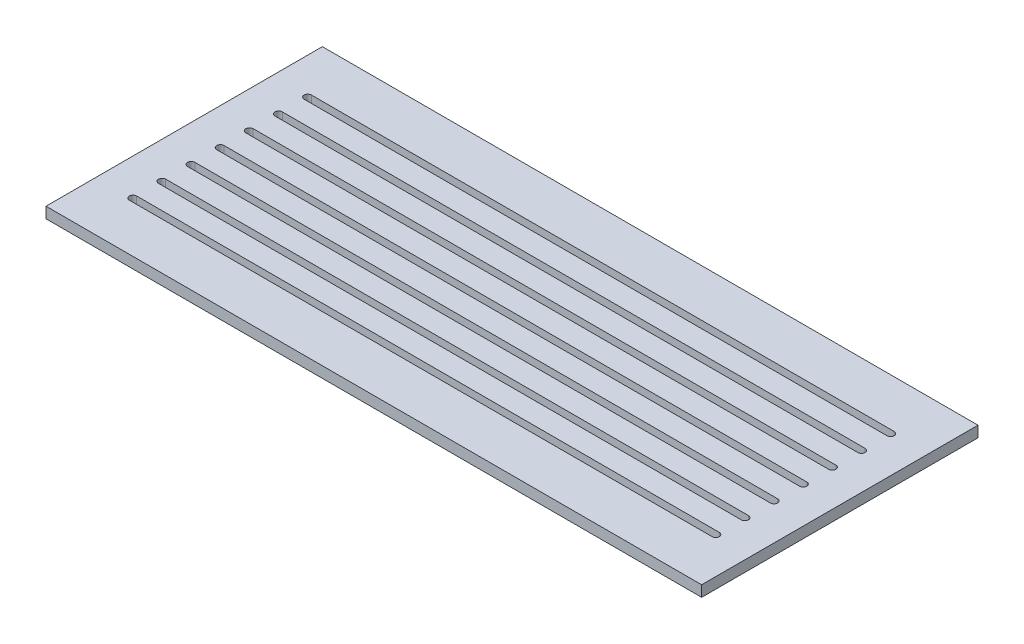
ISO-10303-21;
HEADER;
FILE_DESCRIPTION(('STEP AP214'),'2;1');
FILE_NAME('part.step','',(''),(''),'','','');
FILE_SCHEMA(('AUTOMOTIVE_DESIGN { 1 0 10303 214 1 1 1 1 }'));
ENDSEC;
DATA;
#1=APPLICATION_CONTEXT('core data for automotive mechanical design processes');
#2=APPLICATION_PROTOCOL_DEFINITION('international standard','automotive_design',2000,#1);
#3=PRODUCT_CONTEXT('',#1,'mechanical');
#4=PRODUCT('Part','Part','',(#3));
#5=PRODUCT_RELATED_PRODUCT_CATEGORY('part','',(#4));
#6=PRODUCT_DEFINITION_FORMATION('','',#4);
#7=PRODUCT_DEFINITION_CONTEXT('part definition',#1,'design');
#8=PRODUCT_DEFINITION('design','',#6,#7);
#9=PRODUCT_DEFINITION_SHAPE('','',#8);
#10=(LENGTH_UNIT() NAMED_UNIT(*) SI_UNIT(.MILLI.,.METRE.));
#11=(NAMED_UNIT(*) PLANE_ANGLE_UNIT() SI_UNIT($,.RADIAN.));
#12=(NAMED_UNIT(*) SI_UNIT($,.STERADIAN.) SOLID_ANGLE_UNIT());
#13=UNCERTAINTY_MEASURE_WITH_UNIT(LENGTH_MEASURE(1.E-05),#10,'distance_accuracy_value','');
#14=(GEOMETRIC_REPRESENTATION_CONTEXT(3) GLOBAL_UNCERTAINTY_ASSIGNED_CONTEXT((#13)) GLOBAL_UNIT_ASSIGNED_CONTEXT((#10,
#11,#12)) REPRESENTATION_CONTEXT('',''));
#15=CARTESIAN_POINT('',(0.,0.,0.));
#16=DIRECTION('',(0.,0.,1.));
#17=DIRECTION('',(1.,0.,0.));
#18=AXIS2_PLACEMENT_3D('',#15,#16,#17);
#19=CARTESIAN_POINT('',(0.,3.,0.));
#20=DIRECTION('',(0.,1.,0.));
#21=DIRECTION('',(0.,0.,1.));
#22=AXIS2_PLACEMENT_3D('',#19,#20,#21);
#23=PLANE('',#22);
#24=DIRECTION('',(0.,0.,1.));
#25=VECTOR('',#24,1.);
#26=CARTESIAN_POINT('',(-95.5669699429958,3.,-46.3964757709251));
#27=LINE('',#26,#25);
#28=CARTESIAN_POINT('',(-95.5669699429958,3.,-46.3964757709251));
#29=VERTEX_POINT('',#28);
#30=CARTESIAN_POINT('',(-95.5669699429958,3.,29.4735242290749));
#31=VERTEX_POINT('',#30);
#32=EDGE_CURVE('E532',#29,#31,#27,.T.);
#33=ORIENTED_EDGE('',*,*,#32,.T.);
#34=DIRECTION('',(1.,0.,0.));
#35=VECTOR('',#34,1.);
#36=CARTESIAN_POINT('',(-95.5669699429958,3.,29.4735242290749));
#37=LINE('',#36,#35);
#38=CARTESIAN_POINT('',(84.4330300570043,3.,29.4735242290749));
#39=VERTEX_POINT('',#38);
#40=EDGE_CURVE('E537',#31,#39,#37,.T.);
#41=ORIENTED_EDGE('',*,*,#40,.T.);
#42=DIRECTION('',(0.,0.,-1.));
#43=VECTOR('',#42,1.);
#44=CARTESIAN_POINT('',(84.4330300570043,3.,-46.3964757709251));
#45=LINE('',#44,#43);
#46=CARTESIAN_POINT('',(84.4330300570043,3.,-46.3964757709251));
#47=VERTEX_POINT('',#46);
#48=EDGE_CURVE('E545',#39,#47,#45,.T.);
#49=ORIENTED_EDGE('',*,*,#48,.T.);
#50=DIRECTION('',(-1.,0.,0.));
#51=VECTOR('',#50,1.);
#52=CARTESIAN_POINT('',(-95.5669699429958,3.,-46.3964757709251));
#53=LINE('',#52,#51);
#54=EDGE_CURVE('E548',#47,#29,#53,.T.);
#55=ORIENTED_EDGE('',*,*,#54,.T.);
#56=EDGE_LOOP('',(#33,#41,#49,#55));
#57=FACE_BOUND('',#56,.T.);
#58=DIRECTION('',(1.,0.,0.));
#59=VECTOR('',#58,1.);
#60=CARTESIAN_POINT('',(-85.5669699429958,3.,-31.3964757709251));
#61=LINE('',#60,#59);
#62=CARTESIAN_POINT('',(-85.5669699429958,3.,-31.3964757709251));
#63=VERTEX_POINT('',#62);
#64=CARTESIAN_POINT('',(74.4330300570042,3.,-31.3964757709251));
#65=VERTEX_POINT('',#64);
#66=EDGE_CURVE('E496',#63,#65,#61,.T.);
#67=ORIENTED_EDGE('',*,*,#66,.F.);
#68=CARTESIAN_POINT('',(-85.5669699429958,3.,-32.3964757709251));
#69=DIRECTION('',(0.,1.,0.));
#70=DIRECTION('',(0.,0.,1.));
#71=AXIS2_PLACEMENT_3D('',#68,#69,#70);
#72=CIRCLE('',#71,1.);
#73=CARTESIAN_POINT('',(-85.5669699429958,3.,-33.3964757709251));
#74=VERTEX_POINT('',#73);
#75=EDGE_CURVE('E492',#74,#63,#72,.T.);
#76=ORIENTED_EDGE('',*,*,#75,.F.);
#77=DIRECTION('',(-1.,0.,0.));
#78=VECTOR('',#77,1.);
#79=CARTESIAN_POINT('',(-85.5669699429958,3.,-33.3964757709251));
#80=LINE('',#79,#78);
#81=CARTESIAN_POINT('',(74.4330300570042,3.,-33.3964757709251));
#82=VERTEX_POINT('',#81);
#83=EDGE_CURVE('E505',#82,#74,#80,.T.);
#84=ORIENTED_EDGE('',*,*,#83,.F.);
#85=CARTESIAN_POINT('',(74.4330300570043,3.,-32.3964757709251));
#86=DIRECTION('',(0.,1.,0.));
#87=DIRECTION('',(0.,0.,-1.));
#88=AXIS2_PLACEMENT_3D('',#85,#86,#87);
#89=CIRCLE('',#88,1.);
#90=EDGE_CURVE('E510',#65,#82,#89,.T.);
#91=ORIENTED_EDGE('',*,*,#90,.F.);
#92=EDGE_LOOP('',(#67,#76,#84,#91));
#93=FACE_BOUND('',#92,.T.);
#94=DIRECTION('',(1.,0.,0.));
#95=VECTOR('',#94,1.);
#96=CARTESIAN_POINT('',(-85.5669699429957,3.,-23.3964757709251));
#97=LINE('',#96,#95);
#98=CARTESIAN_POINT('',(-85.5669699429957,3.,-23.3964757709251));
#99=VERTEX_POINT('',#98);
#100=CARTESIAN_POINT('',(74.4330300570043,3.,-23.3964757709251));
#101=VERTEX_POINT('',#100);
#102=EDGE_CURVE('E456',#99,#101,#97,.T.);
#103=ORIENTED_EDGE('',*,*,#102,.F.);
#104=CARTESIAN_POINT('',(-85.5669699429957,3.,-24.3964757709251));
#105=DIRECTION('',(0.,1.,0.));
#106=DIRECTION('',(0.,0.,1.));
#107=AXIS2_PLACEMENT_3D('',#104,#105,#106);
#108=CIRCLE('',#107,1.);
#109=CARTESIAN_POINT('',(-85.5669699429957,3.,-25.3964757709251));
#110=VERTEX_POINT('',#109);
#111=EDGE_CURVE('E452',#110,#99,#108,.T.);
#112=ORIENTED_EDGE('',*,*,#111,.F.);
#113=DIRECTION('',(-1.,0.,0.));
#114=VECTOR('',#113,1.);
#115=CARTESIAN_POINT('',(-85.5669699429957,3.,-25.3964757709251));
#116=LINE('',#115,#114);
#117=CARTESIAN_POINT('',(74.4330300570043,3.,-25.3964757709251));
#118=VERTEX_POINT('',#117);
#119=EDGE_CURVE('E465',#118,#110,#116,.T.);
#120=ORIENTED_EDGE('',*,*,#119,.F.);
#121=CARTESIAN_POINT('',(74.4330300570043,3.,-24.3964757709251));
#122=DIRECTION('',(0.,1.,0.));
#123=DIRECTION('',(0.,0.,-1.));
#124=AXIS2_PLACEMENT_3D('',#121,#122,#123);
#125=CIRCLE('',#124,1.);
#126=EDGE_CURVE('E470',#101,#118,#125,.T.);
#127=ORIENTED_EDGE('',*,*,#126,.F.);
#128=EDGE_LOOP('',(#103,#112,#120,#127));
#129=FACE_BOUND('',#128,.T.);
#130=DIRECTION('',(1.,0.,0.));
#131=VECTOR('',#130,1.);
#132=CARTESIAN_POINT('',(-85.5669699429956,3.,-15.3964757709251));
#133=LINE('',#132,#131);
#134=CARTESIAN_POINT('',(-85.5669699429956,3.,-15.3964757709251));
#135=VERTEX_POINT('',#134);
#136=CARTESIAN_POINT('',(74.4330300570044,3.,-15.3964757709251));
#137=VERTEX_POINT('',#136);
#138=EDGE_CURVE('E416',#135,#137,#133,.T.);
#139=ORIENTED_EDGE('',*,*,#138,.F.);
#140=CARTESIAN_POINT('',(-85.5669699429956,3.,-16.3964757709251));
#141=DIRECTION('',(0.,1.,0.));
#142=DIRECTION('',(0.,0.,1.));
#143=AXIS2_PLACEMENT_3D('',#140,#141,#142);
#144=CIRCLE('',#143,1.);
#145=CARTESIAN_POINT('',(-85.5669699429956,3.,-17.3964757709251));
#146=VERTEX_POINT('',#145);
#147=EDGE_CURVE('E412',#146,#135,#144,.T.);
#148=ORIENTED_EDGE('',*,*,#147,.F.);
#149=DIRECTION('',(-1.,0.,0.));
#150=VECTOR('',#149,1.);
#151=CARTESIAN_POINT('',(-85.5669699429956,3.,-17.3964757709251));
#152=LINE('',#151,#150);
#153=CARTESIAN_POINT('',(74.4330300570044,3.,-17.3964757709251));
#154=VERTEX_POINT('',#153);
#155=EDGE_CURVE('E425',#154,#146,#152,.T.);
#156=ORIENTED_EDGE('',*,*,#155,.F.);
#157=CARTESIAN_POINT('',(74.4330300570044,3.,-16.3964757709251));
#158=DIRECTION('',(0.,1.,0.));
#159=DIRECTION('',(0.,0.,-1.));
#160=AXIS2_PLACEMENT_3D('',#157,#158,#159);
#161=CIRCLE('',#160,1.);
#162=EDGE_CURVE('E430',#137,#154,#161,.T.);
#163=ORIENTED_EDGE('',*,*,#162,.F.);
#164=EDGE_LOOP('',(#139,#148,#156,#163));
#165=FACE_BOUND('',#164,.T.);
#166=DIRECTION('',(1.,0.,0.));
#167=VECTOR('',#166,1.);
#168=CARTESIAN_POINT('',(-85.5669699429955,3.,-7.39647577092511));
#169=LINE('',#168,#167);
#170=CARTESIAN_POINT('',(-85.5669699429955,3.,-7.39647577092511));
#171=VERTEX_POINT('',#170);
#172=CARTESIAN_POINT('',(74.4330300570045,3.,-7.39647577092511));
#173=VERTEX_POINT('',#172);
#174=EDGE_CURVE('E376',#171,#173,#169,.T.);
#175=ORIENTED_EDGE('',*,*,#174,.F.);
#176=CARTESIAN_POINT('',(-85.5669699429955,3.,-8.39647577092511));
#177=DIRECTION('',(0.,1.,0.));
#178=DIRECTION('',(0.,0.,1.));
#179=AXIS2_PLACEMENT_3D('',#176,#177,#178);
#180=CIRCLE('',#179,1.);
#181=CARTESIAN_POINT('',(-85.5669699429955,3.,-9.39647577092511));
#182=VERTEX_POINT('',#181);
#183=EDGE_CURVE('E372',#182,#171,#180,.T.);
#184=ORIENTED_EDGE('',*,*,#183,.F.);
#185=DIRECTION('',(-1.,0.,0.));
#186=VECTOR('',#185,1.);
#187=CARTESIAN_POINT('',(-85.5669699429955,3.,-9.39647577092511));
#188=LINE('',#187,#186);
#189=CARTESIAN_POINT('',(74.4330300570045,3.,-9.39647577092511));
#190=VERTEX_POINT('',#189);
#191=EDGE_CURVE('E385',#190,#182,#188,.T.);
#192=ORIENTED_EDGE('',*,*,#191,.F.);
#193=CARTESIAN_POINT('',(74.4330300570045,3.,-8.39647577092511));
#194=DIRECTION('',(0.,1.,0.));
#195=DIRECTION('',(0.,0.,-1.));
#196=AXIS2_PLACEMENT_3D('',#193,#194,#195);
#197=CIRCLE('',#196,1.);
#198=EDGE_CURVE('E390',#173,#190,#197,.T.);
#199=ORIENTED_EDGE('',*,*,#198,.F.);
#200=EDGE_LOOP('',(#175,#184,#192,#199));
#201=FACE_BOUND('',#200,.T.);
#202=DIRECTION('',(1.,0.,0.));
#203=VECTOR('',#202,1.);
#204=CARTESIAN_POINT('',(-85.5669699429954,3.,0.603524229074892));
#205=LINE('',#204,#203);
#206=CARTESIAN_POINT('',(-85.5669699429954,3.,0.603524229074892));
#207=VERTEX_POINT('',#206);
#208=CARTESIAN_POINT('',(74.4330300570046,3.,0.603524229074892));
#209=VERTEX_POINT('',#208);
#210=EDGE_CURVE('E336',#207,#209,#205,.T.);
#211=ORIENTED_EDGE('',*,*,#210,.F.);
#212=CARTESIAN_POINT('',(-85.5669699429954,3.,-0.396475770925109));
#213=DIRECTION('',(0.,1.,0.));
#214=DIRECTION('',(0.,0.,1.));
#215=AXIS2_PLACEMENT_3D('',#212,#213,#214);
#216=CIRCLE('',#215,1.);
#217=CARTESIAN_POINT('',(-85.5669699429954,3.,-1.39647577092511));
#218=VERTEX_POINT('',#217);
#219=EDGE_CURVE('E332',#218,#207,#216,.T.);
#220=ORIENTED_EDGE('',*,*,#219,.F.);
#221=DIRECTION('',(-1.,0.,0.));
#222=VECTOR('',#221,1.);
#223=CARTESIAN_POINT('',(-85.5669699429954,3.,-1.39647577092511));
#224=LINE('',#223,#222);
#225=CARTESIAN_POINT('',(74.4330300570046,3.,-1.39647577092511));
#226=VERTEX_POINT('',#225);
#227=EDGE_CURVE('E345',#226,#218,#224,.T.);
#228=ORIENTED_EDGE('',*,*,#227,.F.);
#229=CARTESIAN_POINT('',(74.4330300570046,3.,-0.396475770925109));
#230=DIRECTION('',(0.,1.,0.));
#231=DIRECTION('',(0.,0.,-1.));
#232=AXIS2_PLACEMENT_3D('',#229,#230,#231);
#233=CIRCLE('',#232,1.);
#234=EDGE_CURVE('E350',#209,#226,#233,.T.);
#235=ORIENTED_EDGE('',*,*,#234,.F.);
#236=EDGE_LOOP('',(#211,#220,#228,#235));
#237=FACE_BOUND('',#236,.T.);
#238=DIRECTION('',(1.,0.,0.));
#239=VECTOR('',#238,1.);
#240=CARTESIAN_POINT('',(-85.5669699429953,3.,8.60352422907489));
#241=LINE('',#240,#239);
#242=CARTESIAN_POINT('',(-85.5669699429953,3.,8.60352422907489));
#243=VERTEX_POINT('',#242);
#244=CARTESIAN_POINT('',(74.4330300570047,3.,8.60352422907489));
#245=VERTEX_POINT('',#244);
#246=EDGE_CURVE('E298',#243,#245,#241,.T.);
#247=ORIENTED_EDGE('',*,*,#246,.F.);
#248=CARTESIAN_POINT('',(-85.5669699429953,3.,7.60352422907489));
#249=DIRECTION('',(0.,1.,0.));
#250=DIRECTION('',(0.,0.,1.));
#251=AXIS2_PLACEMENT_3D('',#248,#249,#250);
#252=CIRCLE('',#251,1.);
#253=CARTESIAN_POINT('',(-85.5669699429953,3.,6.60352422907489));
#254=VERTEX_POINT('',#253);
#255=EDGE_CURVE('E294',#254,#243,#252,.T.);
#256=ORIENTED_EDGE('',*,*,#255,.F.);
#257=DIRECTION('',(-1.,0.,0.));
#258=VECTOR('',#257,1.);
#259=CARTESIAN_POINT('',(-85.5669699429953,3.,6.60352422907489));
#260=LINE('',#259,#258);
#261=CARTESIAN_POINT('',(74.4330300570047,3.,6.60352422907489));
#262=VERTEX_POINT('',#261);
#263=EDGE_CURVE('E305',#262,#254,#260,.T.);
#264=ORIENTED_EDGE('',*,*,#263,.F.);
#265=CARTESIAN_POINT('',(74.4330300570047,3.,7.60352422907489));
#266=DIRECTION('',(0.,1.,0.));
#267=DIRECTION('',(0.,0.,-1.));
#268=AXIS2_PLACEMENT_3D('',#265,#266,#267);
#269=CIRCLE('',#268,1.);
#270=EDGE_CURVE('E310',#245,#262,#269,.T.);
#271=ORIENTED_EDGE('',*,*,#270,.F.);
#272=EDGE_LOOP('',(#247,#256,#264,#271));
#273=FACE_BOUND('',#272,.T.);
#274=DIRECTION('',(1.,0.,0.));
#275=VECTOR('',#274,1.);
#276=CARTESIAN_POINT('',(-85.5669699429953,3.,16.6035242290749));
#277=LINE('',#276,#275);
#278=CARTESIAN_POINT('',(-85.5669699429953,3.,16.6035242290749));
#279=VERTEX_POINT('',#278);
#280=CARTESIAN_POINT('',(74.4330300570047,3.,16.6035242290749));
#281=VERTEX_POINT('',#280);
#282=EDGE_CURVE('E254',#279,#281,#277,.T.);
#283=ORIENTED_EDGE('',*,*,#282,.F.);
#284=CARTESIAN_POINT('',(-85.5669699429953,3.,15.6035242290749));
#285=DIRECTION('',(0.,1.,0.));
#286=DIRECTION('',(0.,0.,1.));
#287=AXIS2_PLACEMENT_3D('',#284,#285,#286);
#288=CIRCLE('',#287,1.);
#289=CARTESIAN_POINT('',(-85.5669699429953,3.,14.6035242290749));
#290=VERTEX_POINT('',#289);
#291=EDGE_CURVE('E245',#290,#279,#288,.T.);
#292=ORIENTED_EDGE('',*,*,#291,.F.);
#293=DIRECTION('',(-1.,0.,0.));
#294=VECTOR('',#293,1.);
#295=CARTESIAN_POINT('',(-85.5669699429953,3.,14.6035242290749));
#296=LINE('',#295,#294);
#297=CARTESIAN_POINT('',(74.4330300570047,3.,14.6035242290749));
#298=VERTEX_POINT('',#297);
#299=EDGE_CURVE('E271',#298,#290,#296,.T.);
#300=ORIENTED_EDGE('',*,*,#299,.F.);
#301=CARTESIAN_POINT('',(74.4330300570048,3.,15.6035242290749));
#302=DIRECTION('',(0.,1.,0.));
#303=DIRECTION('',(0.,0.,-1.));
#304=AXIS2_PLACEMENT_3D('',#301,#302,#303);
#305=CIRCLE('',#304,1.);
#306=EDGE_CURVE('E266',#281,#298,#305,.T.);
#307=ORIENTED_EDGE('',*,*,#306,.F.);
#308=EDGE_LOOP('',(#283,#292,#300,#307));
#309=FACE_BOUND('',#308,.T.);
#310=ADVANCED_FACE('F36',(#57,#93,#129,#165,#201,#237,#273,#309),#23,.T.);
#311=CARTESIAN_POINT('',(0.,0.,0.));
#312=DIRECTION('',(0.,1.,0.));
#313=DIRECTION('',(0.,0.,1.));
#314=AXIS2_PLACEMENT_3D('',#311,#312,#313);
#315=PLANE('',#314);
#316=CARTESIAN_POINT('',(-85.5669699429953,0.,7.60352422907489));
#317=DIRECTION('',(0.,1.,0.));
#318=DIRECTION('',(0.,0.,1.));
#319=AXIS2_PLACEMENT_3D('',#316,#317,#318);
#320=CIRCLE('',#319,1.);
#321=CARTESIAN_POINT('',(-85.5669699429953,0.,6.60352422907489));
#322=VERTEX_POINT('',#321);
#323=CARTESIAN_POINT('',(-85.5669699429953,0.,8.60352422907489));
#324=VERTEX_POINT('',#323);
#325=EDGE_CURVE('E262',#322,#324,#320,.T.);
#326=ORIENTED_EDGE('',*,*,#325,.T.);
#327=DIRECTION('',(1.,0.,0.));
#328=VECTOR('',#327,1.);
#329=CARTESIAN_POINT('',(-85.5669699429953,0.,8.60352422907489));
#330=LINE('',#329,#328);
#331=CARTESIAN_POINT('',(74.4330300570047,0.,8.60352422907489));
#332=VERTEX_POINT('',#331);
#333=EDGE_CURVE('E314',#324,#332,#330,.T.);
#334=ORIENTED_EDGE('',*,*,#333,.T.);
#335=CARTESIAN_POINT('',(74.4330300570047,0.,7.60352422907489));
#336=DIRECTION('',(0.,1.,0.));
#337=DIRECTION('',(0.,0.,-1.));
#338=AXIS2_PLACEMENT_3D('',#335,#336,#337);
#339=CIRCLE('',#338,1.);
#340=CARTESIAN_POINT('',(74.4330300570047,0.,6.60352422907489));
#341=VERTEX_POINT('',#340);
#342=EDGE_CURVE('E317',#332,#341,#339,.T.);
#343=ORIENTED_EDGE('',*,*,#342,.T.);
#344=DIRECTION('',(-1.,0.,0.));
#345=VECTOR('',#344,1.);
#346=CARTESIAN_POINT('',(-85.5669699429953,0.,6.60352422907489));
#347=LINE('',#346,#345);
#348=EDGE_CURVE('E299',#341,#322,#347,.T.);
#349=ORIENTED_EDGE('',*,*,#348,.T.);
#350=EDGE_LOOP('',(#326,#334,#343,#349));
#351=FACE_BOUND('',#350,.T.);
#352=CARTESIAN_POINT('',(-85.5669699429955,0.,-8.39647577092511));
#353=DIRECTION('',(0.,1.,0.));
#354=DIRECTION('',(0.,0.,1.));
#355=AXIS2_PLACEMENT_3D('',#352,#353,#354);
#356=CIRCLE('',#355,1.);
#357=CARTESIAN_POINT('',(-85.5669699429955,0.,-9.39647577092511));
#358=VERTEX_POINT('',#357);
#359=CARTESIAN_POINT('',(-85.5669699429955,0.,-7.39647577092511));
#360=VERTEX_POINT('',#359);
#361=EDGE_CURVE('E371',#358,#360,#356,.T.);
#362=ORIENTED_EDGE('',*,*,#361,.T.);
#363=DIRECTION('',(1.,0.,0.));
#364=VECTOR('',#363,1.);
#365=CARTESIAN_POINT('',(-85.5669699429955,0.,-7.39647577092511));
#366=LINE('',#365,#364);
#367=CARTESIAN_POINT('',(74.4330300570045,0.,-7.39647577092511));
#368=VERTEX_POINT('',#367);
#369=EDGE_CURVE('E394',#360,#368,#366,.T.);
#370=ORIENTED_EDGE('',*,*,#369,.T.);
#371=CARTESIAN_POINT('',(74.4330300570045,0.,-8.39647577092511));
#372=DIRECTION('',(0.,1.,0.));
#373=DIRECTION('',(0.,0.,-1.));
#374=AXIS2_PLACEMENT_3D('',#371,#372,#373);
#375=CIRCLE('',#374,1.);
#376=CARTESIAN_POINT('',(74.4330300570045,0.,-9.39647577092511));
#377=VERTEX_POINT('',#376);
#378=EDGE_CURVE('E397',#368,#377,#375,.T.);
#379=ORIENTED_EDGE('',*,*,#378,.T.);
#380=DIRECTION('',(-1.,0.,0.));
#381=VECTOR('',#380,1.);
#382=CARTESIAN_POINT('',(-85.5669699429955,0.,-9.39647577092511));
#383=LINE('',#382,#381);
#384=EDGE_CURVE('E377',#377,#358,#383,.T.);
#385=ORIENTED_EDGE('',*,*,#384,.T.);
#386=EDGE_LOOP('',(#362,#370,#379,#385));
#387=FACE_BOUND('',#386,.T.);
#388=CARTESIAN_POINT('',(-85.5669699429957,0.,-24.3964757709251));
#389=DIRECTION('',(0.,1.,0.));
#390=DIRECTION('',(0.,0.,1.));
#391=AXIS2_PLACEMENT_3D('',#388,#389,#390);
#392=CIRCLE('',#391,1.);
#393=CARTESIAN_POINT('',(-85.5669699429957,0.,-25.3964757709251));
#394=VERTEX_POINT('',#393);
#395=CARTESIAN_POINT('',(-85.5669699429957,0.,-23.3964757709251));
#396=VERTEX_POINT('',#395);
#397=EDGE_CURVE('E451',#394,#396,#392,.T.);
#398=ORIENTED_EDGE('',*,*,#397,.T.);
#399=DIRECTION('',(1.,0.,0.));
#400=VECTOR('',#399,1.);
#401=CARTESIAN_POINT('',(-85.5669699429957,0.,-23.3964757709251));
#402=LINE('',#401,#400);
#403=CARTESIAN_POINT('',(74.4330300570043,0.,-23.3964757709251));
#404=VERTEX_POINT('',#403);
#405=EDGE_CURVE('E474',#396,#404,#402,.T.);
#406=ORIENTED_EDGE('',*,*,#405,.T.);
#407=CARTESIAN_POINT('',(74.4330300570043,0.,-24.3964757709251));
#408=DIRECTION('',(0.,1.,0.));
#409=DIRECTION('',(0.,0.,-1.));
#410=AXIS2_PLACEMENT_3D('',#407,#408,#409);
#411=CIRCLE('',#410,1.);
#412=CARTESIAN_POINT('',(74.4330300570043,0.,-25.3964757709251));
#413=VERTEX_POINT('',#412);
#414=EDGE_CURVE('E477',#404,#413,#411,.T.);
#415=ORIENTED_EDGE('',*,*,#414,.T.);
#416=DIRECTION('',(-1.,0.,0.));
#417=VECTOR('',#416,1.);
#418=CARTESIAN_POINT('',(-85.5669699429957,0.,-25.3964757709251));
#419=LINE('',#418,#417);
#420=EDGE_CURVE('E457',#413,#394,#419,.T.);
#421=ORIENTED_EDGE('',*,*,#420,.T.);
#422=EDGE_LOOP('',(#398,#406,#415,#421));
#423=FACE_BOUND('',#422,.T.);
#424=DIRECTION('',(0.,0.,1.));
#425=VECTOR('',#424,1.);
#426=CARTESIAN_POINT('',(-95.5669699429958,0.,-46.3964757709251));
#427=LINE('',#426,#425);
#428=CARTESIAN_POINT('',(-95.5669699429958,0.,-46.3964757709251));
#429=VERTEX_POINT('',#428);
#430=CARTESIAN_POINT('',(-95.5669699429958,0.,29.4735242290749));
#431=VERTEX_POINT('',#430);
#432=EDGE_CURVE('E531',#429,#431,#427,.T.);
#433=ORIENTED_EDGE('',*,*,#432,.F.);
#434=DIRECTION('',(-1.,0.,0.));
#435=VECTOR('',#434,1.);
#436=CARTESIAN_POINT('',(-95.5669699429958,0.,-46.3964757709251));
#437=LINE('',#436,#435);
#438=CARTESIAN_POINT('',(84.4330300570043,0.,-46.3964757709251));
#439=VERTEX_POINT('',#438);
#440=EDGE_CURVE('E538',#439,#429,#437,.T.);
#441=ORIENTED_EDGE('',*,*,#440,.F.);
#442=DIRECTION('',(0.,0.,-1.));
#443=VECTOR('',#442,1.);
#444=CARTESIAN_POINT('',(84.4330300570043,0.,-46.3964757709251));
#445=LINE('',#444,#443);
#446=CARTESIAN_POINT('',(84.4330300570043,0.,29.4735242290749));
#447=VERTEX_POINT('',#446);
#448=EDGE_CURVE('E557',#447,#439,#445,.T.);
#449=ORIENTED_EDGE('',*,*,#448,.F.);
#450=DIRECTION('',(1.,0.,0.));
#451=VECTOR('',#450,1.);
#452=CARTESIAN_POINT('',(-95.5669699429958,0.,29.4735242290749));
#453=LINE('',#452,#451);
#454=EDGE_CURVE('E555',#431,#447,#453,.T.);
#455=ORIENTED_EDGE('',*,*,#454,.F.);
#456=EDGE_LOOP('',(#433,#441,#449,#455));
#457=FACE_BOUND('',#456,.T.);
#458=CARTESIAN_POINT('',(-85.5669699429958,0.,-32.3964757709251));
#459=DIRECTION('',(0.,1.,0.));
#460=DIRECTION('',(0.,0.,1.));
#461=AXIS2_PLACEMENT_3D('',#458,#459,#460);
#462=CIRCLE('',#461,1.);
#463=CARTESIAN_POINT('',(-85.5669699429958,0.,-33.3964757709251));
#464=VERTEX_POINT('',#463);
#465=CARTESIAN_POINT('',(-85.5669699429958,0.,-31.3964757709251));
#466=VERTEX_POINT('',#465);
#467=EDGE_CURVE('E491',#464,#466,#462,.T.);
#468=ORIENTED_EDGE('',*,*,#467,.T.);
#469=DIRECTION('',(1.,0.,0.));
#470=VECTOR('',#469,1.);
#471=CARTESIAN_POINT('',(-85.5669699429958,0.,-31.3964757709251));
#472=LINE('',#471,#470);
#473=CARTESIAN_POINT('',(74.4330300570042,0.,-31.3964757709251));
#474=VERTEX_POINT('',#473);
#475=EDGE_CURVE('E514',#466,#474,#472,.T.);
#476=ORIENTED_EDGE('',*,*,#475,.T.);
#477=CARTESIAN_POINT('',(74.4330300570043,0.,-32.3964757709251));
#478=DIRECTION('',(0.,1.,0.));
#479=DIRECTION('',(0.,0.,-1.));
#480=AXIS2_PLACEMENT_3D('',#477,#478,#479);
#481=CIRCLE('',#480,1.);
#482=CARTESIAN_POINT('',(74.4330300570042,0.,-33.3964757709251));
#483=VERTEX_POINT('',#482);
#484=EDGE_CURVE('E517',#474,#483,#481,.T.);
#485=ORIENTED_EDGE('',*,*,#484,.T.);
#486=DIRECTION('',(-1.,0.,0.));
#487=VECTOR('',#486,1.);
#488=CARTESIAN_POINT('',(-85.5669699429958,0.,-33.3964757709251));
#489=LINE('',#488,#487);
#490=EDGE_CURVE('E497',#483,#464,#489,.T.);
#491=ORIENTED_EDGE('',*,*,#490,.T.);
#492=EDGE_LOOP('',(#468,#476,#485,#491));
#493=FACE_BOUND('',#492,.T.);
#494=CARTESIAN_POINT('',(-85.5669699429956,0.,-16.3964757709251));
#495=DIRECTION('',(0.,1.,0.));
#496=DIRECTION('',(0.,0.,1.));
#497=AXIS2_PLACEMENT_3D('',#494,#495,#496);
#498=CIRCLE('',#497,1.);
#499=CARTESIAN_POINT('',(-85.5669699429956,0.,-17.3964757709251));
#500=VERTEX_POINT('',#499);
#501=CARTESIAN_POINT('',(-85.5669699429956,0.,-15.3964757709251));
#502=VERTEX_POINT('',#501);
#503=EDGE_CURVE('E411',#500,#502,#498,.T.);
#504=ORIENTED_EDGE('',*,*,#503,.T.);
#505=DIRECTION('',(1.,0.,0.));
#506=VECTOR('',#505,1.);
#507=CARTESIAN_POINT('',(-85.5669699429956,0.,-15.3964757709251));
#508=LINE('',#507,#506);
#509=CARTESIAN_POINT('',(74.4330300570044,0.,-15.3964757709251));
#510=VERTEX_POINT('',#509);
#511=EDGE_CURVE('E434',#502,#510,#508,.T.);
#512=ORIENTED_EDGE('',*,*,#511,.T.);
#513=CARTESIAN_POINT('',(74.4330300570044,0.,-16.3964757709251));
#514=DIRECTION('',(0.,1.,0.));
#515=DIRECTION('',(0.,0.,-1.));
#516=AXIS2_PLACEMENT_3D('',#513,#514,#515);
#517=CIRCLE('',#516,1.);
#518=CARTESIAN_POINT('',(74.4330300570044,0.,-17.3964757709251));
#519=VERTEX_POINT('',#518);
#520=EDGE_CURVE('E437',#510,#519,#517,.T.);
#521=ORIENTED_EDGE('',*,*,#520,.T.);
#522=DIRECTION('',(-1.,0.,0.));
#523=VECTOR('',#522,1.);
#524=CARTESIAN_POINT('',(-85.5669699429956,0.,-17.3964757709251));
#525=LINE('',#524,#523);
#526=EDGE_CURVE('E417',#519,#500,#525,.T.);
#527=ORIENTED_EDGE('',*,*,#526,.T.);
#528=EDGE_LOOP('',(#504,#512,#521,#527));
#529=FACE_BOUND('',#528,.T.);
#530=CARTESIAN_POINT('',(-85.5669699429954,0.,-0.396475770925109));
#531=DIRECTION('',(0.,1.,0.));
#532=DIRECTION('',(0.,0.,1.));
#533=AXIS2_PLACEMENT_3D('',#530,#531,#532);
#534=CIRCLE('',#533,1.);
#535=CARTESIAN_POINT('',(-85.5669699429954,0.,-1.39647577092511));
#536=VERTEX_POINT('',#535);
#537=CARTESIAN_POINT('',(-85.5669699429954,0.,0.603524229074892));
#538=VERTEX_POINT('',#537);
#539=EDGE_CURVE('E331',#536,#538,#534,.T.);
#540=ORIENTED_EDGE('',*,*,#539,.T.);
#541=DIRECTION('',(1.,0.,0.));
#542=VECTOR('',#541,1.);
#543=CARTESIAN_POINT('',(-85.5669699429954,0.,0.603524229074892));
#544=LINE('',#543,#542);
#545=CARTESIAN_POINT('',(74.4330300570046,0.,0.603524229074892));
#546=VERTEX_POINT('',#545);
#547=EDGE_CURVE('E354',#538,#546,#544,.T.);
#548=ORIENTED_EDGE('',*,*,#547,.T.);
#549=CARTESIAN_POINT('',(74.4330300570046,0.,-0.396475770925109));
#550=DIRECTION('',(0.,1.,0.));
#551=DIRECTION('',(0.,0.,-1.));
#552=AXIS2_PLACEMENT_3D('',#549,#550,#551);
#553=CIRCLE('',#552,1.);
#554=CARTESIAN_POINT('',(74.4330300570046,0.,-1.39647577092511));
#555=VERTEX_POINT('',#554);
#556=EDGE_CURVE('E357',#546,#555,#553,.T.);
#557=ORIENTED_EDGE('',*,*,#556,.T.);
#558=DIRECTION('',(-1.,0.,0.));
#559=VECTOR('',#558,1.);
#560=CARTESIAN_POINT('',(-85.5669699429954,0.,-1.39647577092511));
#561=LINE('',#560,#559);
#562=EDGE_CURVE('E337',#555,#536,#561,.T.);
#563=ORIENTED_EDGE('',*,*,#562,.T.);
#564=EDGE_LOOP('',(#540,#548,#557,#563));
#565=FACE_BOUND('',#564,.T.);
#566=CARTESIAN_POINT('',(-85.5669699429953,0.,15.6035242290749));
#567=DIRECTION('',(0.,1.,0.));
#568=DIRECTION('',(0.,0.,1.));
#569=AXIS2_PLACEMENT_3D('',#566,#567,#568);
#570=CIRCLE('',#569,1.);
#571=CARTESIAN_POINT('',(-85.5669699429953,0.,14.6035242290749));
#572=VERTEX_POINT('',#571);
#573=CARTESIAN_POINT('',(-85.5669699429953,0.,16.6035242290749));
#574=VERTEX_POINT('',#573);
#575=EDGE_CURVE('E59',#572,#574,#570,.T.);
#576=ORIENTED_EDGE('',*,*,#575,.T.);
#577=DIRECTION('',(1.,0.,0.));
#578=VECTOR('',#577,1.);
#579=CARTESIAN_POINT('',(-85.5669699429953,0.,16.6035242290749));
#580=LINE('',#579,#578);
#581=CARTESIAN_POINT('',(74.4330300570047,0.,16.6035242290749));
#582=VERTEX_POINT('',#581);
#583=EDGE_CURVE('E261',#574,#582,#580,.T.);
#584=ORIENTED_EDGE('',*,*,#583,.T.);
#585=CARTESIAN_POINT('',(74.4330300570048,0.,15.6035242290749));
#586=DIRECTION('',(0.,1.,0.));
#587=DIRECTION('',(0.,0.,-1.));
#588=AXIS2_PLACEMENT_3D('',#585,#586,#587);
#589=CIRCLE('',#588,1.);
#590=CARTESIAN_POINT('',(74.4330300570047,0.,14.6035242290749));
#591=VERTEX_POINT('',#590);
#592=EDGE_CURVE('E286',#582,#591,#589,.T.);
#593=ORIENTED_EDGE('',*,*,#592,.T.);
#594=DIRECTION('',(-1.,0.,0.));
#595=VECTOR('',#594,1.);
#596=CARTESIAN_POINT('',(-85.5669699429953,0.,14.6035242290749));
#597=LINE('',#596,#595);
#598=EDGE_CURVE('E255',#591,#572,#597,.T.);
#599=ORIENTED_EDGE('',*,*,#598,.T.);
#600=EDGE_LOOP('',(#576,#584,#593,#599));
#601=FACE_BOUND('',#600,.T.);
#602=ADVANCED_FACE('F575',(#351,#387,#423,#457,#493,#529,#565,#601),#315,.F.);
#603=CARTESIAN_POINT('',(-95.5669699429958,3.,-46.3964757709251));
#604=DIRECTION('',(1.,0.,0.));
#605=DIRECTION('',(0.,0.,-1.));
#606=AXIS2_PLACEMENT_3D('',#603,#604,#605);
#607=PLANE('',#606);
#608=ORIENTED_EDGE('',*,*,#432,.T.);
#609=DIRECTION('',(0.,-1.,0.));
#610=VECTOR('',#609,1.);
#611=CARTESIAN_POINT('',(-95.5669699429958,3.,29.4735242290749));
#612=LINE('',#611,#610);
#613=EDGE_CURVE('E12',#31,#431,#612,.T.);
#614=ORIENTED_EDGE('',*,*,#613,.F.);
#615=ORIENTED_EDGE('',*,*,#32,.F.);
#616=DIRECTION('',(0.,-1.,0.));
#617=VECTOR('',#616,1.);
#618=CARTESIAN_POINT('',(-95.5669699429958,3.,-46.3964757709251));
#619=LINE('',#618,#617);
#620=EDGE_CURVE('E552',#29,#429,#619,.T.);
#621=ORIENTED_EDGE('',*,*,#620,.T.);
#622=EDGE_LOOP('',(#608,#614,#615,#621));
#623=FACE_BOUND('',#622,.T.);
#624=ADVANCED_FACE('F38',(#623),#607,.F.);
#625=CARTESIAN_POINT('',(-95.5669699429958,3.,29.4735242290749));
#626=DIRECTION('',(0.,0.,-1.));
#627=DIRECTION('',(-1.,0.,0.));
#628=AXIS2_PLACEMENT_3D('',#625,#626,#627);
#629=PLANE('',#628);
#630=ORIENTED_EDGE('',*,*,#454,.T.);
#631=DIRECTION('',(0.,-1.,0.));
#632=VECTOR('',#631,1.);
#633=CARTESIAN_POINT('',(84.4330300570043,3.,29.4735242290749));
#634=LINE('',#633,#632);
#635=EDGE_CURVE('E44',#39,#447,#634,.T.);
#636=ORIENTED_EDGE('',*,*,#635,.F.);
#637=ORIENTED_EDGE('',*,*,#40,.F.);
#638=ORIENTED_EDGE('',*,*,#613,.T.);
#639=EDGE_LOOP('',(#630,#636,#637,#638));
#640=FACE_BOUND('',#639,.T.);
#641=ADVANCED_FACE('F646',(#640),#629,.F.);
#642=CARTESIAN_POINT('',(84.4330300570043,3.,-46.3964757709251));
#643=DIRECTION('',(-1.,0.,0.));
#644=DIRECTION('',(0.,0.,1.));
#645=AXIS2_PLACEMENT_3D('',#642,#643,#644);
#646=PLANE('',#645);
#647=ORIENTED_EDGE('',*,*,#448,.T.);
#648=DIRECTION('',(0.,-1.,0.));
#649=VECTOR('',#648,1.);
#650=CARTESIAN_POINT('',(84.4330300570043,3.,-46.3964757709251));
#651=LINE('',#650,#649);
#652=EDGE_CURVE('E562',#47,#439,#651,.T.);
#653=ORIENTED_EDGE('',*,*,#652,.F.);
#654=ORIENTED_EDGE('',*,*,#48,.F.);
#655=ORIENTED_EDGE('',*,*,#635,.T.);
#656=EDGE_LOOP('',(#647,#653,#654,#655));
#657=FACE_BOUND('',#656,.T.);
#658=ADVANCED_FACE('F569',(#657),#646,.F.);
#659=CARTESIAN_POINT('',(-95.5669699429958,3.,-46.3964757709251));
#660=DIRECTION('',(0.,0.,1.));
#661=DIRECTION('',(1.,0.,0.));
#662=AXIS2_PLACEMENT_3D('',#659,#660,#661);
#663=PLANE('',#662);
#664=ORIENTED_EDGE('',*,*,#440,.T.);
#665=ORIENTED_EDGE('',*,*,#620,.F.);
#666=ORIENTED_EDGE('',*,*,#54,.F.);
#667=ORIENTED_EDGE('',*,*,#652,.T.);
#668=EDGE_LOOP('',(#664,#665,#666,#667));
#669=FACE_BOUND('',#668,.T.);
#670=ADVANCED_FACE('F579',(#669),#663,.F.);
#671=CARTESIAN_POINT('',(-85.5669699429958,3.,-32.3964757709251));
#672=DIRECTION('',(0.,-1.,0.));
#673=DIRECTION('',(0.,0.,-1.));
#674=AXIS2_PLACEMENT_3D('',#671,#672,#673);
#675=CYLINDRICAL_SURFACE('',#674,1.);
#676=ORIENTED_EDGE('',*,*,#467,.F.);
#677=DIRECTION('',(0.,-1.,0.));
#678=VECTOR('',#677,1.);
#679=CARTESIAN_POINT('',(-85.5669699429958,3.,-33.3964757709251));
#680=LINE('',#679,#678);
#681=EDGE_CURVE('E509',#74,#464,#680,.T.);
#682=ORIENTED_EDGE('',*,*,#681,.F.);
#683=ORIENTED_EDGE('',*,*,#75,.T.);
#684=DIRECTION('',(0.,-1.,0.));
#685=VECTOR('',#684,1.);
#686=CARTESIAN_POINT('',(-85.5669699429958,3.,-31.3964757709251));
#687=LINE('',#686,#685);
#688=EDGE_CURVE('E528',#63,#466,#687,.T.);
#689=ORIENTED_EDGE('',*,*,#688,.T.);
#690=EDGE_LOOP('',(#676,#682,#683,#689));
#691=FACE_BOUND('',#690,.T.);
#692=ADVANCED_FACE('F640',(#691),#675,.F.);
#693=CARTESIAN_POINT('',(-85.5669699429958,3.,-31.3964757709251));
#694=DIRECTION('',(0.,0.,-1.));
#695=DIRECTION('',(-1.,0.,0.));
#696=AXIS2_PLACEMENT_3D('',#693,#694,#695);
#697=PLANE('',#696);
#698=ORIENTED_EDGE('',*,*,#475,.F.);
#699=ORIENTED_EDGE('',*,*,#688,.F.);
#700=ORIENTED_EDGE('',*,*,#66,.T.);
#701=DIRECTION('',(0.,-1.,0.));
#702=VECTOR('',#701,1.);
#703=CARTESIAN_POINT('',(74.4330300570042,3.,-31.3964757709251));
#704=LINE('',#703,#702);
#705=EDGE_CURVE('E526',#65,#474,#704,.T.);
#706=ORIENTED_EDGE('',*,*,#705,.T.);
#707=EDGE_LOOP('',(#698,#699,#700,#706));
#708=FACE_BOUND('',#707,.T.);
#709=ADVANCED_FACE('F687',(#708),#697,.T.);
#710=CARTESIAN_POINT('',(74.4330300570043,3.,-32.3964757709251));
#711=DIRECTION('',(0.,-1.,0.));
#712=DIRECTION('',(0.,0.,-1.));
#713=AXIS2_PLACEMENT_3D('',#710,#711,#712);
#714=CYLINDRICAL_SURFACE('',#713,1.);
#715=ORIENTED_EDGE('',*,*,#484,.F.);
#716=ORIENTED_EDGE('',*,*,#705,.F.);
#717=ORIENTED_EDGE('',*,*,#90,.T.);
#718=DIRECTION('',(0.,-1.,0.));
#719=VECTOR('',#718,1.);
#720=CARTESIAN_POINT('',(74.4330300570042,3.,-33.3964757709251));
#721=LINE('',#720,#719);
#722=EDGE_CURVE('E524',#82,#483,#721,.T.);
#723=ORIENTED_EDGE('',*,*,#722,.T.);
#724=EDGE_LOOP('',(#715,#716,#717,#723));
#725=FACE_BOUND('',#724,.T.);
#726=ADVANCED_FACE('F695',(#725),#714,.F.);
#727=CARTESIAN_POINT('',(-85.5669699429958,3.,-33.3964757709251));
#728=DIRECTION('',(0.,0.,1.));
#729=DIRECTION('',(1.,0.,0.));
#730=AXIS2_PLACEMENT_3D('',#727,#728,#729);
#731=PLANE('',#730);
#732=ORIENTED_EDGE('',*,*,#490,.F.);
#733=ORIENTED_EDGE('',*,*,#722,.F.);
#734=ORIENTED_EDGE('',*,*,#83,.T.);
#735=ORIENTED_EDGE('',*,*,#681,.T.);
#736=EDGE_LOOP('',(#732,#733,#734,#735));
#737=FACE_BOUND('',#736,.T.);
#738=ADVANCED_FACE('F703',(#737),#731,.T.);
#739=CARTESIAN_POINT('',(-85.5669699429957,3.,-24.3964757709251));
#740=DIRECTION('',(0.,-1.,0.));
#741=DIRECTION('',(0.,0.,-1.));
#742=AXIS2_PLACEMENT_3D('',#739,#740,#741);
#743=CYLINDRICAL_SURFACE('',#742,1.);
#744=ORIENTED_EDGE('',*,*,#397,.F.);
#745=DIRECTION('',(0.,-1.,0.));
#746=VECTOR('',#745,1.);
#747=CARTESIAN_POINT('',(-85.5669699429957,3.,-25.3964757709251));
#748=LINE('',#747,#746);
#749=EDGE_CURVE('E469',#110,#394,#748,.T.);
#750=ORIENTED_EDGE('',*,*,#749,.F.);
#751=ORIENTED_EDGE('',*,*,#111,.T.);
#752=DIRECTION('',(0.,-1.,0.));
#753=VECTOR('',#752,1.);
#754=CARTESIAN_POINT('',(-85.5669699429957,3.,-23.3964757709251));
#755=LINE('',#754,#753);
#756=EDGE_CURVE('E488',#99,#396,#755,.T.);
#757=ORIENTED_EDGE('',*,*,#756,.T.);
#758=EDGE_LOOP('',(#744,#750,#751,#757));
#759=FACE_BOUND('',#758,.T.);
#760=ADVANCED_FACE('F712',(#759),#743,.F.);
#761=CARTESIAN_POINT('',(-85.5669699429957,3.,-23.3964757709251));
#762=DIRECTION('',(0.,0.,-1.));
#763=DIRECTION('',(-1.,0.,0.));
#764=AXIS2_PLACEMENT_3D('',#761,#762,#763);
#765=PLANE('',#764);
#766=ORIENTED_EDGE('',*,*,#405,.F.);
#767=ORIENTED_EDGE('',*,*,#756,.F.);
#768=ORIENTED_EDGE('',*,*,#102,.T.);
#769=DIRECTION('',(0.,-1.,0.));
#770=VECTOR('',#769,1.);
#771=CARTESIAN_POINT('',(74.4330300570043,3.,-23.3964757709251));
#772=LINE('',#771,#770);
#773=EDGE_CURVE('E486',#101,#404,#772,.T.);
#774=ORIENTED_EDGE('',*,*,#773,.T.);
#775=EDGE_LOOP('',(#766,#767,#768,#774));
#776=FACE_BOUND('',#775,.T.);
#777=ADVANCED_FACE('F721',(#776),#765,.T.);
#778=CARTESIAN_POINT('',(74.4330300570043,3.,-24.3964757709251));
#779=DIRECTION('',(0.,-1.,0.));
#780=DIRECTION('',(0.,0.,-1.));
#781=AXIS2_PLACEMENT_3D('',#778,#779,#780);
#782=CYLINDRICAL_SURFACE('',#781,1.);
#783=ORIENTED_EDGE('',*,*,#414,.F.);
#784=ORIENTED_EDGE('',*,*,#773,.F.);
#785=ORIENTED_EDGE('',*,*,#126,.T.);
#786=DIRECTION('',(0.,-1.,0.));
#787=VECTOR('',#786,1.);
#788=CARTESIAN_POINT('',(74.4330300570043,3.,-25.3964757709251));
#789=LINE('',#788,#787);
#790=EDGE_CURVE('E484',#118,#413,#789,.T.);
#791=ORIENTED_EDGE('',*,*,#790,.T.);
#792=EDGE_LOOP('',(#783,#784,#785,#791));
#793=FACE_BOUND('',#792,.T.);
#794=ADVANCED_FACE('F730',(#793),#782,.F.);
#795=CARTESIAN_POINT('',(-85.5669699429957,3.,-25.3964757709251));
#796=DIRECTION('',(0.,0.,1.));
#797=DIRECTION('',(1.,0.,0.));
#798=AXIS2_PLACEMENT_3D('',#795,#796,#797);
#799=PLANE('',#798);
#800=ORIENTED_EDGE('',*,*,#420,.F.);
#801=ORIENTED_EDGE('',*,*,#790,.F.);
#802=ORIENTED_EDGE('',*,*,#119,.T.);
#803=ORIENTED_EDGE('',*,*,#749,.T.);
#804=EDGE_LOOP('',(#800,#801,#802,#803));
#805=FACE_BOUND('',#804,.T.);
#806=ADVANCED_FACE('F739',(#805),#799,.T.);
#807=CARTESIAN_POINT('',(-85.5669699429956,3.,-16.3964757709251));
#808=DIRECTION('',(0.,-1.,0.));
#809=DIRECTION('',(0.,0.,-1.));
#810=AXIS2_PLACEMENT_3D('',#807,#808,#809);
#811=CYLINDRICAL_SURFACE('',#810,1.);
#812=ORIENTED_EDGE('',*,*,#503,.F.);
#813=DIRECTION('',(0.,-1.,0.));
#814=VECTOR('',#813,1.);
#815=CARTESIAN_POINT('',(-85.5669699429956,3.,-17.3964757709251));
#816=LINE('',#815,#814);
#817=EDGE_CURVE('E429',#146,#500,#816,.T.);
#818=ORIENTED_EDGE('',*,*,#817,.F.);
#819=ORIENTED_EDGE('',*,*,#147,.T.);
#820=DIRECTION('',(0.,-1.,0.));
#821=VECTOR('',#820,1.);
#822=CARTESIAN_POINT('',(-85.5669699429956,3.,-15.3964757709251));
#823=LINE('',#822,#821);
#824=EDGE_CURVE('E448',#135,#502,#823,.T.);
#825=ORIENTED_EDGE('',*,*,#824,.T.);
#826=EDGE_LOOP('',(#812,#818,#819,#825));
#827=FACE_BOUND('',#826,.T.);
#828=ADVANCED_FACE('F748',(#827),#811,.F.);
#829=CARTESIAN_POINT('',(-85.5669699429956,3.,-15.3964757709251));
#830=DIRECTION('',(0.,0.,-1.));
#831=DIRECTION('',(-1.,0.,0.));
#832=AXIS2_PLACEMENT_3D('',#829,#830,#831);
#833=PLANE('',#832);
#834=ORIENTED_EDGE('',*,*,#511,.F.);
#835=ORIENTED_EDGE('',*,*,#824,.F.);
#836=ORIENTED_EDGE('',*,*,#138,.T.);
#837=DIRECTION('',(0.,-1.,0.));
#838=VECTOR('',#837,1.);
#839=CARTESIAN_POINT('',(74.4330300570044,3.,-15.3964757709251));
#840=LINE('',#839,#838);
#841=EDGE_CURVE('E446',#137,#510,#840,.T.);
#842=ORIENTED_EDGE('',*,*,#841,.T.);
#843=EDGE_LOOP('',(#834,#835,#836,#842));
#844=FACE_BOUND('',#843,.T.);
#845=ADVANCED_FACE('F757',(#844),#833,.T.);
#846=CARTESIAN_POINT('',(74.4330300570044,3.,-16.3964757709251));
#847=DIRECTION('',(0.,-1.,0.));
#848=DIRECTION('',(0.,0.,-1.));
#849=AXIS2_PLACEMENT_3D('',#846,#847,#848);
#850=CYLINDRICAL_SURFACE('',#849,1.);
#851=ORIENTED_EDGE('',*,*,#520,.F.);
#852=ORIENTED_EDGE('',*,*,#841,.F.);
#853=ORIENTED_EDGE('',*,*,#162,.T.);
#854=DIRECTION('',(0.,-1.,0.));
#855=VECTOR('',#854,1.);
#856=CARTESIAN_POINT('',(74.4330300570044,3.,-17.3964757709251));
#857=LINE('',#856,#855);
#858=EDGE_CURVE('E444',#154,#519,#857,.T.);
#859=ORIENTED_EDGE('',*,*,#858,.T.);
#860=EDGE_LOOP('',(#851,#852,#853,#859));
#861=FACE_BOUND('',#860,.T.);
#862=ADVANCED_FACE('F766',(#861),#850,.F.);
#863=CARTESIAN_POINT('',(-85.5669699429956,3.,-17.3964757709251));
#864=DIRECTION('',(0.,0.,1.));
#865=DIRECTION('',(1.,0.,0.));
#866=AXIS2_PLACEMENT_3D('',#863,#864,#865);
#867=PLANE('',#866);
#868=ORIENTED_EDGE('',*,*,#526,.F.);
#869=ORIENTED_EDGE('',*,*,#858,.F.);
#870=ORIENTED_EDGE('',*,*,#155,.T.);
#871=ORIENTED_EDGE('',*,*,#817,.T.);
#872=EDGE_LOOP('',(#868,#869,#870,#871));
#873=FACE_BOUND('',#872,.T.);
#874=ADVANCED_FACE('F775',(#873),#867,.T.);
#875=CARTESIAN_POINT('',(-85.5669699429955,3.,-8.39647577092511));
#876=DIRECTION('',(0.,-1.,0.));
#877=DIRECTION('',(0.,0.,-1.));
#878=AXIS2_PLACEMENT_3D('',#875,#876,#877);
#879=CYLINDRICAL_SURFACE('',#878,1.);
#880=ORIENTED_EDGE('',*,*,#361,.F.);
#881=DIRECTION('',(0.,-1.,0.));
#882=VECTOR('',#881,1.);
#883=CARTESIAN_POINT('',(-85.5669699429955,3.,-9.39647577092511));
#884=LINE('',#883,#882);
#885=EDGE_CURVE('E389',#182,#358,#884,.T.);
#886=ORIENTED_EDGE('',*,*,#885,.F.);
#887=ORIENTED_EDGE('',*,*,#183,.T.);
#888=DIRECTION('',(0.,-1.,0.));
#889=VECTOR('',#888,1.);
#890=CARTESIAN_POINT('',(-85.5669699429955,3.,-7.39647577092511));
#891=LINE('',#890,#889);
#892=EDGE_CURVE('E408',#171,#360,#891,.T.);
#893=ORIENTED_EDGE('',*,*,#892,.T.);
#894=EDGE_LOOP('',(#880,#886,#887,#893));
#895=FACE_BOUND('',#894,.T.);
#896=ADVANCED_FACE('F784',(#895),#879,.F.);
#897=CARTESIAN_POINT('',(-85.5669699429955,3.,-7.39647577092511));
#898=DIRECTION('',(0.,0.,-1.));
#899=DIRECTION('',(-1.,0.,0.));
#900=AXIS2_PLACEMENT_3D('',#897,#898,#899);
#901=PLANE('',#900);
#902=ORIENTED_EDGE('',*,*,#369,.F.);
#903=ORIENTED_EDGE('',*,*,#892,.F.);
#904=ORIENTED_EDGE('',*,*,#174,.T.);
#905=DIRECTION('',(0.,-1.,0.));
#906=VECTOR('',#905,1.);
#907=CARTESIAN_POINT('',(74.4330300570045,3.,-7.39647577092511));
#908=LINE('',#907,#906);
#909=EDGE_CURVE('E406',#173,#368,#908,.T.);
#910=ORIENTED_EDGE('',*,*,#909,.T.);
#911=EDGE_LOOP('',(#902,#903,#904,#910));
#912=FACE_BOUND('',#911,.T.);
#913=ADVANCED_FACE('F793',(#912),#901,.T.);
#914=CARTESIAN_POINT('',(74.4330300570045,3.,-8.39647577092511));
#915=DIRECTION('',(0.,-1.,0.));
#916=DIRECTION('',(0.,0.,-1.));
#917=AXIS2_PLACEMENT_3D('',#914,#915,#916);
#918=CYLINDRICAL_SURFACE('',#917,1.);
#919=ORIENTED_EDGE('',*,*,#378,.F.);
#920=ORIENTED_EDGE('',*,*,#909,.F.);
#921=ORIENTED_EDGE('',*,*,#198,.T.);
#922=DIRECTION('',(0.,-1.,0.));
#923=VECTOR('',#922,1.);
#924=CARTESIAN_POINT('',(74.4330300570045,3.,-9.39647577092511));
#925=LINE('',#924,#923);
#926=EDGE_CURVE('E404',#190,#377,#925,.T.);
#927=ORIENTED_EDGE('',*,*,#926,.T.);
#928=EDGE_LOOP('',(#919,#920,#921,#927));
#929=FACE_BOUND('',#928,.T.);
#930=ADVANCED_FACE('F802',(#929),#918,.F.);
#931=CARTESIAN_POINT('',(-85.5669699429955,3.,-9.39647577092511));
#932=DIRECTION('',(0.,0.,1.));
#933=DIRECTION('',(1.,0.,0.));
#934=AXIS2_PLACEMENT_3D('',#931,#932,#933);
#935=PLANE('',#934);
#936=ORIENTED_EDGE('',*,*,#384,.F.);
#937=ORIENTED_EDGE('',*,*,#926,.F.);
#938=ORIENTED_EDGE('',*,*,#191,.T.);
#939=ORIENTED_EDGE('',*,*,#885,.T.);
#940=EDGE_LOOP('',(#936,#937,#938,#939));
#941=FACE_BOUND('',#940,.T.);
#942=ADVANCED_FACE('F811',(#941),#935,.T.);
#943=CARTESIAN_POINT('',(-85.5669699429954,3.,-0.396475770925109));
#944=DIRECTION('',(0.,-1.,0.));
#945=DIRECTION('',(0.,0.,-1.));
#946=AXIS2_PLACEMENT_3D('',#943,#944,#945);
#947=CYLINDRICAL_SURFACE('',#946,1.);
#948=ORIENTED_EDGE('',*,*,#539,.F.);
#949=DIRECTION('',(0.,-1.,0.));
#950=VECTOR('',#949,1.);
#951=CARTESIAN_POINT('',(-85.5669699429954,3.,-1.39647577092511));
#952=LINE('',#951,#950);
#953=EDGE_CURVE('E349',#218,#536,#952,.T.);
#954=ORIENTED_EDGE('',*,*,#953,.F.);
#955=ORIENTED_EDGE('',*,*,#219,.T.);
#956=DIRECTION('',(0.,-1.,0.));
#957=VECTOR('',#956,1.);
#958=CARTESIAN_POINT('',(-85.5669699429954,3.,0.603524229074892));
#959=LINE('',#958,#957);
#960=EDGE_CURVE('E368',#207,#538,#959,.T.);
#961=ORIENTED_EDGE('',*,*,#960,.T.);
#962=EDGE_LOOP('',(#948,#954,#955,#961));
#963=FACE_BOUND('',#962,.T.);
#964=ADVANCED_FACE('F820',(#963),#947,.F.);
#965=CARTESIAN_POINT('',(-85.5669699429954,3.,0.603524229074892));
#966=DIRECTION('',(0.,0.,-1.));
#967=DIRECTION('',(-1.,0.,0.));
#968=AXIS2_PLACEMENT_3D('',#965,#966,#967);
#969=PLANE('',#968);
#970=ORIENTED_EDGE('',*,*,#547,.F.);
#971=ORIENTED_EDGE('',*,*,#960,.F.);
#972=ORIENTED_EDGE('',*,*,#210,.T.);
#973=DIRECTION('',(0.,-1.,0.));
#974=VECTOR('',#973,1.);
#975=CARTESIAN_POINT('',(74.4330300570046,3.,0.603524229074892));
#976=LINE('',#975,#974);
#977=EDGE_CURVE('E366',#209,#546,#976,.T.);
#978=ORIENTED_EDGE('',*,*,#977,.T.);
#979=EDGE_LOOP('',(#970,#971,#972,#978));
#980=FACE_BOUND('',#979,.T.);
#981=ADVANCED_FACE('F829',(#980),#969,.T.);
#982=CARTESIAN_POINT('',(74.4330300570046,3.,-0.396475770925109));
#983=DIRECTION('',(0.,-1.,0.));
#984=DIRECTION('',(0.,0.,-1.));
#985=AXIS2_PLACEMENT_3D('',#982,#983,#984);
#986=CYLINDRICAL_SURFACE('',#985,1.);
#987=ORIENTED_EDGE('',*,*,#556,.F.);
#988=ORIENTED_EDGE('',*,*,#977,.F.);
#989=ORIENTED_EDGE('',*,*,#234,.T.);
#990=DIRECTION('',(0.,-1.,0.));
#991=VECTOR('',#990,1.);
#992=CARTESIAN_POINT('',(74.4330300570046,3.,-1.39647577092511));
#993=LINE('',#992,#991);
#994=EDGE_CURVE('E364',#226,#555,#993,.T.);
#995=ORIENTED_EDGE('',*,*,#994,.T.);
#996=EDGE_LOOP('',(#987,#988,#989,#995));
#997=FACE_BOUND('',#996,.T.);
#998=ADVANCED_FACE('F838',(#997),#986,.F.);
#999=CARTESIAN_POINT('',(-85.5669699429954,3.,-1.39647577092511));
#1000=DIRECTION('',(0.,0.,1.));
#1001=DIRECTION('',(1.,0.,0.));
#1002=AXIS2_PLACEMENT_3D('',#999,#1000,#1001);
#1003=PLANE('',#1002);
#1004=ORIENTED_EDGE('',*,*,#562,.F.);
#1005=ORIENTED_EDGE('',*,*,#994,.F.);
#1006=ORIENTED_EDGE('',*,*,#227,.T.);
#1007=ORIENTED_EDGE('',*,*,#953,.T.);
#1008=EDGE_LOOP('',(#1004,#1005,#1006,#1007));
#1009=FACE_BOUND('',#1008,.T.);
#1010=ADVANCED_FACE('F631',(#1009),#1003,.T.);
#1011=CARTESIAN_POINT('',(-85.5669699429953,3.,7.60352422907489));
#1012=DIRECTION('',(0.,-1.,0.));
#1013=DIRECTION('',(0.,0.,-1.));
#1014=AXIS2_PLACEMENT_3D('',#1011,#1012,#1013);
#1015=CYLINDRICAL_SURFACE('',#1014,1.);
#1016=ORIENTED_EDGE('',*,*,#325,.F.);
#1017=DIRECTION('',(0.,-1.,0.));
#1018=VECTOR('',#1017,1.);
#1019=CARTESIAN_POINT('',(-85.5669699429953,3.,6.60352422907489));
#1020=LINE('',#1019,#1018);
#1021=EDGE_CURVE('E309',#254,#322,#1020,.T.);
#1022=ORIENTED_EDGE('',*,*,#1021,.F.);
#1023=ORIENTED_EDGE('',*,*,#255,.T.);
#1024=DIRECTION('',(0.,-1.,0.));
#1025=VECTOR('',#1024,1.);
#1026=CARTESIAN_POINT('',(-85.5669699429953,3.,8.60352422907489));
#1027=LINE('',#1026,#1025);
#1028=EDGE_CURVE('E328',#243,#324,#1027,.T.);
#1029=ORIENTED_EDGE('',*,*,#1028,.T.);
#1030=EDGE_LOOP('',(#1016,#1022,#1023,#1029));
#1031=FACE_BOUND('',#1030,.T.);
#1032=ADVANCED_FACE('F618',(#1031),#1015,.F.);
#1033=CARTESIAN_POINT('',(-85.5669699429953,3.,8.60352422907489));
#1034=DIRECTION('',(0.,0.,-1.));
#1035=DIRECTION('',(-1.,0.,0.));
#1036=AXIS2_PLACEMENT_3D('',#1033,#1034,#1035);
#1037=PLANE('',#1036);
#1038=ORIENTED_EDGE('',*,*,#333,.F.);
#1039=ORIENTED_EDGE('',*,*,#1028,.F.);
#1040=ORIENTED_EDGE('',*,*,#246,.T.);
#1041=DIRECTION('',(0.,-1.,0.));
#1042=VECTOR('',#1041,1.);
#1043=CARTESIAN_POINT('',(74.4330300570047,3.,8.60352422907489));
#1044=LINE('',#1043,#1042);
#1045=EDGE_CURVE('E326',#245,#332,#1044,.T.);
#1046=ORIENTED_EDGE('',*,*,#1045,.T.);
#1047=EDGE_LOOP('',(#1038,#1039,#1040,#1046));
#1048=FACE_BOUND('',#1047,.T.);
#1049=ADVANCED_FACE('F623',(#1048),#1037,.T.);
#1050=CARTESIAN_POINT('',(74.4330300570047,3.,7.60352422907489));
#1051=DIRECTION('',(0.,-1.,0.));
#1052=DIRECTION('',(0.,0.,-1.));
#1053=AXIS2_PLACEMENT_3D('',#1050,#1051,#1052);
#1054=CYLINDRICAL_SURFACE('',#1053,1.);
#1055=ORIENTED_EDGE('',*,*,#342,.F.);
#1056=ORIENTED_EDGE('',*,*,#1045,.F.);
#1057=ORIENTED_EDGE('',*,*,#270,.T.);
#1058=DIRECTION('',(0.,-1.,0.));
#1059=VECTOR('',#1058,1.);
#1060=CARTESIAN_POINT('',(74.4330300570047,3.,6.60352422907489));
#1061=LINE('',#1060,#1059);
#1062=EDGE_CURVE('E324',#262,#341,#1061,.T.);
#1063=ORIENTED_EDGE('',*,*,#1062,.T.);
#1064=EDGE_LOOP('',(#1055,#1056,#1057,#1063));
#1065=FACE_BOUND('',#1064,.T.);
#1066=ADVANCED_FACE('F609',(#1065),#1054,.F.);
#1067=CARTESIAN_POINT('',(-85.5669699429953,3.,6.60352422907489));
#1068=DIRECTION('',(0.,0.,1.));
#1069=DIRECTION('',(1.,0.,0.));
#1070=AXIS2_PLACEMENT_3D('',#1067,#1068,#1069);
#1071=PLANE('',#1070);
#1072=ORIENTED_EDGE('',*,*,#348,.F.);
#1073=ORIENTED_EDGE('',*,*,#1062,.F.);
#1074=ORIENTED_EDGE('',*,*,#263,.T.);
#1075=ORIENTED_EDGE('',*,*,#1021,.T.);
#1076=EDGE_LOOP('',(#1072,#1073,#1074,#1075));
#1077=FACE_BOUND('',#1076,.T.);
#1078=ADVANCED_FACE('F616',(#1077),#1071,.T.);
#1079=CARTESIAN_POINT('',(-85.5669699429953,3.,15.6035242290749));
#1080=DIRECTION('',(0.,-1.,0.));
#1081=DIRECTION('',(0.,0.,-1.));
#1082=AXIS2_PLACEMENT_3D('',#1079,#1080,#1081);
#1083=CYLINDRICAL_SURFACE('',#1082,1.);
#1084=ORIENTED_EDGE('',*,*,#575,.F.);
#1085=DIRECTION('',(0.,-1.,0.));
#1086=VECTOR('',#1085,1.);
#1087=CARTESIAN_POINT('',(-85.5669699429953,3.,14.6035242290749));
#1088=LINE('',#1087,#1086);
#1089=EDGE_CURVE('E249',#290,#572,#1088,.T.);
#1090=ORIENTED_EDGE('',*,*,#1089,.F.);
#1091=ORIENTED_EDGE('',*,*,#291,.T.);
#1092=DIRECTION('',(0.,-1.,0.));
#1093=VECTOR('',#1092,1.);
#1094=CARTESIAN_POINT('',(-85.5669699429953,3.,16.6035242290749));
#1095=LINE('',#1094,#1093);
#1096=EDGE_CURVE('E248',#279,#574,#1095,.T.);
#1097=ORIENTED_EDGE('',*,*,#1096,.T.);
#1098=EDGE_LOOP('',(#1084,#1090,#1091,#1097));
#1099=FACE_BOUND('',#1098,.T.);
#1100=ADVANCED_FACE('F247',(#1099),#1083,.F.);
#1101=CARTESIAN_POINT('',(-85.5669699429953,3.,16.6035242290749));
#1102=DIRECTION('',(0.,0.,-1.));
#1103=DIRECTION('',(-1.,0.,0.));
#1104=AXIS2_PLACEMENT_3D('',#1101,#1102,#1103);
#1105=PLANE('',#1104);
#1106=ORIENTED_EDGE('',*,*,#583,.F.);
#1107=ORIENTED_EDGE('',*,*,#1096,.F.);
#1108=ORIENTED_EDGE('',*,*,#282,.T.);
#1109=DIRECTION('',(0.,-1.,0.));
#1110=VECTOR('',#1109,1.);
#1111=CARTESIAN_POINT('',(74.4330300570047,3.,16.6035242290749));
#1112=LINE('',#1111,#1110);
#1113=EDGE_CURVE('E263',#281,#582,#1112,.T.);
#1114=ORIENTED_EDGE('',*,*,#1113,.T.);
#1115=EDGE_LOOP('',(#1106,#1107,#1108,#1114));
#1116=FACE_BOUND('',#1115,.T.);
#1117=ADVANCED_FACE('F258',(#1116),#1105,.T.);
#1118=CARTESIAN_POINT('',(74.4330300570048,3.,15.6035242290749));
#1119=DIRECTION('',(0.,-1.,0.));
#1120=DIRECTION('',(0.,0.,-1.));
#1121=AXIS2_PLACEMENT_3D('',#1118,#1119,#1120);
#1122=CYLINDRICAL_SURFACE('',#1121,1.);
#1123=ORIENTED_EDGE('',*,*,#592,.F.);
#1124=ORIENTED_EDGE('',*,*,#1113,.F.);
#1125=ORIENTED_EDGE('',*,*,#306,.T.);
#1126=DIRECTION('',(0.,-1.,0.));
#1127=VECTOR('',#1126,1.);
#1128=CARTESIAN_POINT('',(74.4330300570047,3.,14.6035242290749));
#1129=LINE('',#1128,#1127);
#1130=EDGE_CURVE('E51',#298,#591,#1129,.T.);
#1131=ORIENTED_EDGE('',*,*,#1130,.T.);
#1132=EDGE_LOOP('',(#1123,#1124,#1125,#1131));
#1133=FACE_BOUND('',#1132,.T.);
#1134=ADVANCED_FACE('F891',(#1133),#1122,.F.);
#1135=CARTESIAN_POINT('',(-85.5669699429953,3.,14.6035242290749));
#1136=DIRECTION('',(0.,0.,1.));
#1137=DIRECTION('',(1.,0.,0.));
#1138=AXIS2_PLACEMENT_3D('',#1135,#1136,#1137);
#1139=PLANE('',#1138);
#1140=ORIENTED_EDGE('',*,*,#598,.F.);
#1141=ORIENTED_EDGE('',*,*,#1130,.F.);
#1142=ORIENTED_EDGE('',*,*,#299,.T.);
#1143=ORIENTED_EDGE('',*,*,#1089,.T.);
#1144=EDGE_LOOP('',(#1140,#1141,#1142,#1143));
#1145=FACE_BOUND('',#1144,.T.);
#1146=ADVANCED_FACE('F899',(#1145),#1139,.T.);
#1147=CLOSED_SHELL('',(#310,#602,#624,#641,#658,#670,#692,#709,#726,#738,#760,#777,#794,#806,
#828,#845,#862,#874,#896,#913,#930,#942,#964,#981,#998,#1010,#1032,#1049,#1066,#1078,#1100,
#1117,#1134,#1146));
#1148=MANIFOLD_SOLID_BREP('B2',#1147);
#1149=ADVANCED_BREP_SHAPE_REPRESENTATION('',(#18,#1148),#14);
#1150=SHAPE_DEFINITION_REPRESENTATION(#9,#1149);
ENDSEC;
END-ISO-10303-21;
